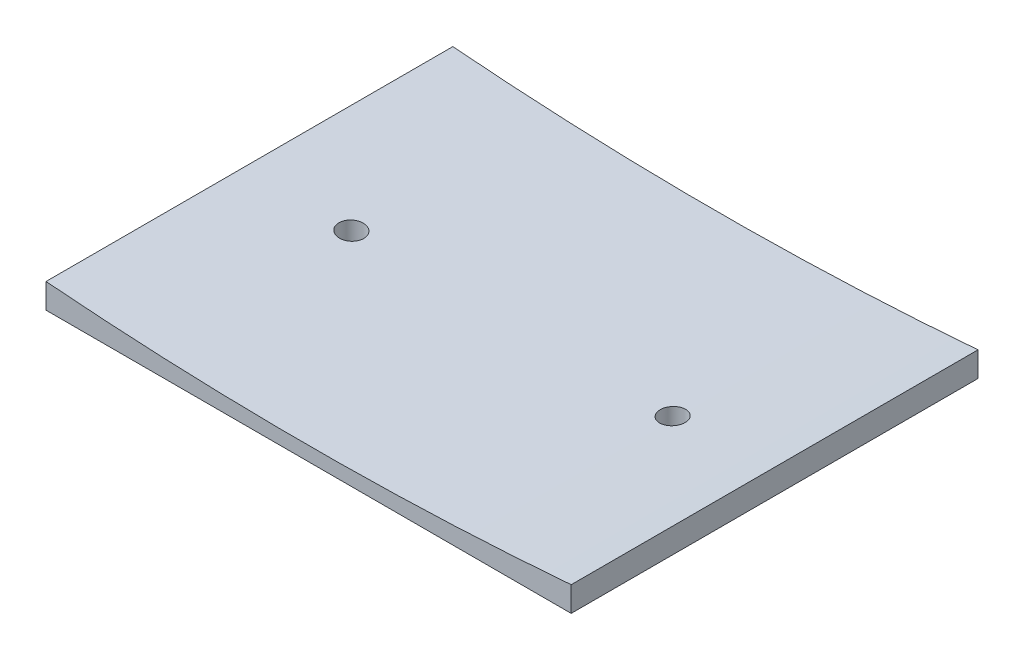
ISO-10303-21;
HEADER;
FILE_DESCRIPTION(('STEP AP214'),'2;1');
FILE_NAME('part.step','',(''),(''),'','','');
FILE_SCHEMA(('AUTOMOTIVE_DESIGN { 1 0 10303 214 1 1 1 1 }'));
ENDSEC;
DATA;
#1=APPLICATION_CONTEXT('core data for automotive mechanical design processes');
#2=APPLICATION_PROTOCOL_DEFINITION('international standard','automotive_design',2000,#1);
#3=PRODUCT_CONTEXT('',#1,'mechanical');
#4=PRODUCT('Part','Part','',(#3));
#5=PRODUCT_RELATED_PRODUCT_CATEGORY('part','',(#4));
#6=PRODUCT_DEFINITION_FORMATION('','',#4);
#7=PRODUCT_DEFINITION_CONTEXT('part definition',#1,'design');
#8=PRODUCT_DEFINITION('design','',#6,#7);
#9=PRODUCT_DEFINITION_SHAPE('','',#8);
#10=(LENGTH_UNIT() NAMED_UNIT(*) SI_UNIT(.MILLI.,.METRE.));
#11=(NAMED_UNIT(*) PLANE_ANGLE_UNIT() SI_UNIT($,.RADIAN.));
#12=(NAMED_UNIT(*) SI_UNIT($,.STERADIAN.) SOLID_ANGLE_UNIT());
#13=UNCERTAINTY_MEASURE_WITH_UNIT(LENGTH_MEASURE(1.E-05),#10,'distance_accuracy_value','');
#14=(GEOMETRIC_REPRESENTATION_CONTEXT(3) GLOBAL_UNCERTAINTY_ASSIGNED_CONTEXT((#13)) GLOBAL_UNIT_ASSIGNED_CONTEXT((#10,
#11,#12)) REPRESENTATION_CONTEXT('',''));
#15=CARTESIAN_POINT('',(0.,0.,0.));
#16=DIRECTION('',(0.,0.,1.));
#17=DIRECTION('',(1.,0.,0.));
#18=AXIS2_PLACEMENT_3D('',#15,#16,#17);
#19=CARTESIAN_POINT('',(-18.6005226480836,2.5,-9.07029616724739));
#20=DIRECTION('',(1.,0.,0.));
#21=DIRECTION('',(0.,0.,-1.));
#22=AXIS2_PLACEMENT_3D('',#19,#20,#21);
#23=PLANE('',#22);
#24=DIRECTION('',(0.,0.,1.));
#25=VECTOR('',#24,1.);
#26=CARTESIAN_POINT('',(-18.6005226480836,0.,-9.07029616724739));
#27=LINE('',#26,#25);
#28=CARTESIAN_POINT('',(-18.6005226480836,0.,-9.07029616724739));
#29=VERTEX_POINT('',#28);
#30=CARTESIAN_POINT('',(-18.6005226480836,0.,31.8297038327526));
#31=VERTEX_POINT('',#30);
#32=EDGE_CURVE('E105',#29,#31,#27,.T.);
#33=ORIENTED_EDGE('',*,*,#32,.T.);
#34=DIRECTION('',(0.,-1.,0.));
#35=VECTOR('',#34,1.);
#36=CARTESIAN_POINT('',(-18.6005226480836,2.5,31.8297038327526));
#37=LINE('',#36,#35);
#38=CARTESIAN_POINT('',(-18.6005226480836,2.5,31.8297038327526));
#39=VERTEX_POINT('',#38);
#40=EDGE_CURVE('E11',#39,#31,#37,.T.);
#41=ORIENTED_EDGE('',*,*,#40,.F.);
#42=DIRECTION('',(0.,0.,1.));
#43=VECTOR('',#42,1.);
#44=CARTESIAN_POINT('',(-18.6005226480836,2.5,-9.07029616724739));
#45=LINE('',#44,#43);
#46=CARTESIAN_POINT('',(-18.6005226480836,2.5,-9.07029616724739));
#47=VERTEX_POINT('',#46);
#48=EDGE_CURVE('E107',#47,#39,#45,.T.);
#49=ORIENTED_EDGE('',*,*,#48,.F.);
#50=DIRECTION('',(0.,-1.,0.));
#51=VECTOR('',#50,1.);
#52=CARTESIAN_POINT('',(-18.6005226480836,2.5,-9.07029616724739));
#53=LINE('',#52,#51);
#54=EDGE_CURVE('E100',#47,#29,#53,.T.);
#55=ORIENTED_EDGE('',*,*,#54,.T.);
#56=EDGE_LOOP('',(#33,#41,#49,#55));
#57=FACE_BOUND('',#56,.T.);
#58=ADVANCED_FACE('F40',(#57),#23,.F.);
#59=CARTESIAN_POINT('',(-18.6005226480836,2.5,31.8297038327526));
#60=DIRECTION('',(0.,0.,-1.));
#61=DIRECTION('',(-1.,0.,0.));
#62=AXIS2_PLACEMENT_3D('',#59,#60,#61);
#63=PLANE('',#62);
#64=DIRECTION('',(0.,-1.,0.));
#65=VECTOR('',#64,1.);
#66=CARTESIAN_POINT('',(34.1994773519164,2.5,31.8297038327526));
#67=LINE('',#66,#65);
#68=CARTESIAN_POINT('',(34.1994773519164,2.5,31.8297038327526));
#69=VERTEX_POINT('',#68);
#70=CARTESIAN_POINT('',(34.1994773519164,0.,31.8297038327526));
#71=VERTEX_POINT('',#70);
#72=EDGE_CURVE('E55',#69,#71,#67,.T.);
#73=ORIENTED_EDGE('',*,*,#72,.F.);
#74=CARTESIAN_POINT('',(7.79947735191637,325.208465073981,31.8297038327526));
#75=DIRECTION('',(0.,0.,1.));
#76=DIRECTION('',(1.,0.,0.));
#77=AXIS2_PLACEMENT_3D('',#74,#75,#76);
#78=CIRCLE('',#77,323.786524473155);
#79=EDGE_CURVE('E63',#39,#69,#78,.T.);
#80=ORIENTED_EDGE('',*,*,#79,.F.);
#81=ORIENTED_EDGE('',*,*,#40,.T.);
#82=DIRECTION('',(1.,0.,0.));
#83=VECTOR('',#82,1.);
#84=CARTESIAN_POINT('',(-18.6005226480836,0.,31.8297038327526));
#85=LINE('',#84,#83);
#86=EDGE_CURVE('E90',#31,#71,#85,.T.);
#87=ORIENTED_EDGE('',*,*,#86,.T.);
#88=EDGE_LOOP('',(#73,#80,#81,#87));
#89=FACE_BOUND('',#88,.T.);
#90=ADVANCED_FACE('F142',(#89),#63,.F.);
#91=CARTESIAN_POINT('',(34.1994773519164,2.5,-9.07029616724739));
#92=DIRECTION('',(-1.,0.,0.));
#93=DIRECTION('',(0.,0.,1.));
#94=AXIS2_PLACEMENT_3D('',#91,#92,#93);
#95=PLANE('',#94);
#96=DIRECTION('',(0.,0.,-1.));
#97=VECTOR('',#96,1.);
#98=CARTESIAN_POINT('',(34.1994773519164,0.,-9.07029616724739));
#99=LINE('',#98,#97);
#100=CARTESIAN_POINT('',(34.1994773519164,0.,-9.07029616724739));
#101=VERTEX_POINT('',#100);
#102=EDGE_CURVE('E81',#71,#101,#99,.T.);
#103=ORIENTED_EDGE('',*,*,#102,.T.);
#104=DIRECTION('',(0.,-1.,0.));
#105=VECTOR('',#104,1.);
#106=CARTESIAN_POINT('',(34.1994773519164,2.5,-9.07029616724739));
#107=LINE('',#106,#105);
#108=CARTESIAN_POINT('',(34.1994773519164,2.5,-9.07029616724739));
#109=VERTEX_POINT('',#108);
#110=EDGE_CURVE('E85',#109,#101,#107,.T.);
#111=ORIENTED_EDGE('',*,*,#110,.F.);
#112=DIRECTION('',(0.,0.,-1.));
#113=VECTOR('',#112,1.);
#114=CARTESIAN_POINT('',(34.1994773519164,2.5,-9.07029616724739));
#115=LINE('',#114,#113);
#116=EDGE_CURVE('E111',#69,#109,#115,.T.);
#117=ORIENTED_EDGE('',*,*,#116,.F.);
#118=ORIENTED_EDGE('',*,*,#72,.T.);
#119=EDGE_LOOP('',(#103,#111,#117,#118));
#120=FACE_BOUND('',#119,.T.);
#121=ADVANCED_FACE('F83',(#120),#95,.F.);
#122=CARTESIAN_POINT('',(-18.6005226480836,2.5,-9.07029616724739));
#123=DIRECTION('',(0.,0.,1.));
#124=DIRECTION('',(1.,0.,0.));
#125=AXIS2_PLACEMENT_3D('',#122,#123,#124);
#126=PLANE('',#125);
#127=ORIENTED_EDGE('',*,*,#54,.F.);
#128=CARTESIAN_POINT('',(7.79947735191637,325.208465073981,-9.07029616724739));
#129=DIRECTION('',(0.,0.,1.));
#130=DIRECTION('',(1.,0.,0.));
#131=AXIS2_PLACEMENT_3D('',#128,#129,#130);
#132=CIRCLE('',#131,323.786524473155);
#133=EDGE_CURVE('E98',#47,#109,#132,.T.);
#134=ORIENTED_EDGE('',*,*,#133,.T.);
#135=ORIENTED_EDGE('',*,*,#110,.T.);
#136=DIRECTION('',(-1.,0.,0.));
#137=VECTOR('',#136,1.);
#138=CARTESIAN_POINT('',(-18.6005226480836,0.,-9.07029616724739));
#139=LINE('',#138,#137);
#140=EDGE_CURVE('E89',#101,#29,#139,.T.);
#141=ORIENTED_EDGE('',*,*,#140,.T.);
#142=EDGE_LOOP('',(#127,#134,#135,#141));
#143=FACE_BOUND('',#142,.T.);
#144=ADVANCED_FACE('F95',(#143),#126,.F.);
#145=CARTESIAN_POINT('',(0.,0.,0.));
#146=DIRECTION('',(0.,1.,0.));
#147=DIRECTION('',(0.,0.,1.));
#148=AXIS2_PLACEMENT_3D('',#145,#146,#147);
#149=PLANE('',#148);
#150=CARTESIAN_POINT('',(23.9494773519164,0.,11.3797038327526));
#151=DIRECTION('',(0.,-1.,0.));
#152=DIRECTION('',(0.,0.,-1.));
#153=AXIS2_PLACEMENT_3D('',#150,#151,#152);
#154=CIRCLE('',#153,1.25);
#155=CARTESIAN_POINT('',(23.9494773519164,0.,10.1297038327526));
#156=VERTEX_POINT('',#155);
#157=EDGE_CURVE('E125',#156,#156,#154,.T.);
#158=ORIENTED_EDGE('',*,*,#157,.F.);
#159=EDGE_LOOP('',(#158));
#160=FACE_BOUND('',#159,.T.);
#161=CARTESIAN_POINT('',(-8.35052264808363,0.,11.3797038327526));
#162=DIRECTION('',(0.,-1.,0.));
#163=DIRECTION('',(0.,0.,1.));
#164=AXIS2_PLACEMENT_3D('',#161,#162,#163);
#165=CIRCLE('',#164,1.24999999999999);
#166=CARTESIAN_POINT('',(-8.35052264808363,0.,12.6297038327526));
#167=VERTEX_POINT('',#166);
#168=EDGE_CURVE('E162',#167,#167,#165,.T.);
#169=ORIENTED_EDGE('',*,*,#168,.F.);
#170=EDGE_LOOP('',(#169));
#171=FACE_BOUND('',#170,.T.);
#172=ORIENTED_EDGE('',*,*,#32,.F.);
#173=ORIENTED_EDGE('',*,*,#140,.F.);
#174=ORIENTED_EDGE('',*,*,#102,.F.);
#175=ORIENTED_EDGE('',*,*,#86,.F.);
#176=EDGE_LOOP('',(#172,#173,#174,#175));
#177=FACE_BOUND('',#176,.T.);
#178=ADVANCED_FACE('F103',(#160,#171,#177),#149,.F.);
#179=CARTESIAN_POINT('',(7.79947735191637,325.208465073981,-12.1702961672474));
#180=DIRECTION('',(0.,0.,1.));
#181=DIRECTION('',(1.,0.,0.));
#182=AXIS2_PLACEMENT_3D('',#179,#180,#181);
#183=CYLINDRICAL_SURFACE('',#182,323.786524473155);
#184=CARTESIAN_POINT('',(23.9494773519164,1.82496065483967,10.1297038327526));
#185=CARTESIAN_POINT('',(24.0197636927124,1.82847083703618,10.1297069401704));
#186=CARTESIAN_POINT('',(24.090099856463,1.83200666023192,10.1356518100633));
#187=CARTESIAN_POINT('',(24.2288338842924,1.83902539986659,10.1592847907752));
#188=CARTESIAN_POINT('',(24.2972293076047,1.84250824733175,10.1769870601796));
#189=CARTESIAN_POINT('',(24.4300532026421,1.84931212185383,10.2236342546326));
#190=CARTESIAN_POINT('',(24.494483470964,1.85263322205337,10.2525740439031));
#191=CARTESIAN_POINT('',(24.6175544571581,1.85901089956226,10.320871798772));
#192=CARTESIAN_POINT('',(24.6761966240745,1.86206754305425,10.3602271477185));
#193=CARTESIAN_POINT('',(24.7860210524993,1.86781840002,10.4482297549607));
#194=CARTESIAN_POINT('',(24.8372061267597,1.87051275011805,10.4968734936738));
#195=CARTESIAN_POINT('',(24.9306829686503,1.87545187969879,10.6020871717782));
#196=CARTESIAN_POINT('',(24.9729744394138,1.87769664417428,10.6586573756483));
#197=CARTESIAN_POINT('',(25.047403903478,1.88165849498276,10.7780402870238));
#198=CARTESIAN_POINT('',(25.0795547076515,1.88337624702382,10.8408449853713));
#199=CARTESIAN_POINT('',(25.132854998672,1.88622926840286,10.970973132148));
#200=CARTESIAN_POINT('',(25.1540045933826,1.88736454345185,11.0382965362652));
#201=CARTESIAN_POINT('',(25.1846760611835,1.88901231197104,11.1754580403795));
#202=CARTESIAN_POINT('',(25.1942128626014,1.88952560499937,11.2452927928032));
#203=CARTESIAN_POINT('',(25.2014351005326,1.88991424422863,11.3855739494131));
#204=CARTESIAN_POINT('',(25.1991206170339,1.88978959473524,11.4560203494679));
#205=CARTESIAN_POINT('',(25.1827123254534,1.88890699209856,11.5954757515237));
#206=CARTESIAN_POINT('',(25.1686263635739,1.88814946079861,11.6644856796016));
#207=CARTESIAN_POINT('',(25.1290884951054,1.88602787434271,11.7991589627235));
#208=CARTESIAN_POINT('',(25.1036365723563,1.88466381832441,11.8648223130093));
#209=CARTESIAN_POINT('',(25.0420841964588,1.88137544950612,11.9909622264446));
#210=CARTESIAN_POINT('',(25.005980431636,1.87945096246965,12.051437168951));
#211=CARTESIAN_POINT('',(24.9241566693137,1.87510697195462,12.1654676902541));
#212=CARTESIAN_POINT('',(24.8784366239669,1.87268746601301,12.21902323462));
#213=CARTESIAN_POINT('',(24.7786238885172,1.86743070371227,12.3177600163255));
#214=CARTESIAN_POINT('',(24.7245218705321,1.86459298211525,12.3629317991764));
#215=CARTESIAN_POINT('',(24.6095193416885,1.8585938376055,12.4435534695097));
#216=CARTESIAN_POINT('',(24.5486187791321,1.85543241223127,12.4790032830567));
#217=CARTESIAN_POINT('',(24.4216592958226,1.84888111373083,12.539224039541));
#218=CARTESIAN_POINT('',(24.3555935498903,1.84549093917783,12.563980560967));
#219=CARTESIAN_POINT('',(24.2202488855139,1.83858972829037,12.6020477640625));
#220=CARTESIAN_POINT('',(24.1509699483873,1.8350786912532,12.6153583791728));
#221=CARTESIAN_POINT('',(24.011097317626,1.82803629835686,12.6301650888787));
#222=CARTESIAN_POINT('',(23.9405024789726,1.82450492684527,12.6316503618577));
#223=CARTESIAN_POINT('',(23.8000630453098,1.81752575802991,12.6227348321638));
#224=CARTESIAN_POINT('',(23.730218451653,1.81407796087677,12.6123340080676));
#225=CARTESIAN_POINT('',(23.5932551643084,1.80736007121259,12.579936480853));
#226=CARTESIAN_POINT('',(23.5261367725719,1.80408999837263,12.5579384969967));
#227=CARTESIAN_POINT('',(23.396543160149,1.79781407226831,12.5029659795623));
#228=CARTESIAN_POINT('',(23.3340679266869,1.79480821827695,12.4699914761872));
#229=CARTESIAN_POINT('',(23.2155796409165,1.78913859251309,12.3940231013656));
#230=CARTESIAN_POINT('',(23.159562382274,1.78647459794465,12.351035807397));
#231=CARTESIAN_POINT('',(23.0555403472984,1.78155108956403,12.2562469969583));
#232=CARTESIAN_POINT('',(23.0075355308741,1.779291573728,12.2044455245935));
#233=CARTESIAN_POINT('',(22.9209564883051,1.77523211684377,12.0935578688271));
#234=CARTESIAN_POINT('',(22.8823722531984,1.77343168794443,12.0344795181192));
#235=CARTESIAN_POINT('',(22.815670600584,1.77032803619595,11.9106713861647));
#236=CARTESIAN_POINT('',(22.7875531110448,1.7690248099251,11.8459416438145));
#237=CARTESIAN_POINT('',(22.7426125401691,1.7669453980834,11.7127397103122));
#238=CARTESIAN_POINT('',(22.7257778903254,1.76616867267201,11.6442714305158));
#239=CARTESIAN_POINT('',(22.7038379767266,1.76515692361025,11.5054767391227));
#240=CARTESIAN_POINT('',(22.6987326853171,1.7649218986827,11.4351503319075));
#241=CARTESIAN_POINT('',(22.7003969649203,1.76499856769418,11.2946819512316));
#242=CARTESIAN_POINT('',(22.7071592311731,1.76530992532194,11.2245398909133));
#243=CARTESIAN_POINT('',(22.7323512703214,1.7664720306968,11.0863878802989));
#244=CARTESIAN_POINT('',(22.7507810543498,1.76732277895859,11.0183779320373));
#245=CARTESIAN_POINT('',(22.7987822714772,1.76954525177355,10.8864186213499));
#246=CARTESIAN_POINT('',(22.8283538978636,1.77091698536472,10.8224693293904));
#247=CARTESIAN_POINT('',(22.8977941498268,1.77415108877822,10.7004468339061));
#248=CARTESIAN_POINT('',(22.9376623944256,1.77601344044758,10.6423734130828));
#249=CARTESIAN_POINT('',(23.0265832549812,1.78018762635834,10.5337146775265));
#250=CARTESIAN_POINT('',(23.0756405100915,1.78249968766239,10.483133168352));
#251=CARTESIAN_POINT('',(23.1815464340428,1.78751926916149,10.3909101760858));
#252=CARTESIAN_POINT('',(23.2383970733411,1.79022688937996,10.3492709607941));
#253=CARTESIAN_POINT('',(23.358347279694,1.79597520178645,10.2760682381427));
#254=CARTESIAN_POINT('',(23.4214561006938,1.79901638794296,10.2445199522433));
#255=CARTESIAN_POINT('',(23.5520129794338,1.80534927992667,10.1925017892884));
#256=CARTESIAN_POINT('',(23.619455765119,1.80864068223828,10.1720187270501));
#257=CARTESIAN_POINT('',(23.7310177369714,1.81412172459221,10.1481568899067));
#258=CARTESIAN_POINT('',(23.774415530683,1.81626249436661,10.1412454949097));
#259=CARTESIAN_POINT('',(23.8616948542848,1.82058572660683,10.132017994559));
#260=CARTESIAN_POINT('',(23.9055763844538,1.82276818909667,10.1297018918542));
#261=CARTESIAN_POINT('',(23.9494773519164,1.82496065483967,10.1297038327526));
#262=B_SPLINE_CURVE_WITH_KNOTS('',3,(#184,#185,#186,#187,#188,#189,#190,#191,#192,#193,#194,
#195,#196,#197,#198,#199,#200,#201,#202,#203,#204,#205,#206,#207,#208,#209,#210,#211,#212,#213,
#214,#215,#216,#217,#218,#219,#220,#221,#222,#223,#224,#225,#226,#227,#228,#229,#230,#231,#232,
#233,#234,#235,#236,#237,#238,#239,#240,#241,#242,#243,#244,#245,#246,#247,#248,#249,#250,#251,
#252,#253,#254,#255,#256,#257,#258,#259,#260,#261),.UNSPECIFIED.,.T.,.F.,(4,2,2,2,2,2,2,2,2,2,2,
2,2,2,2,2,2,2,2,2,2,2,2,2,2,2,2,2,2,2,2,2,2,2,2,2,2,2,4),(0.,0.210961445976418,0.42217739928785,
0.633296935953374,0.844363484320879,1.05535021290774,1.26634398307263,1.47707012365299,
1.68779419808504,1.89824709828353,2.1086985780724,2.319009894577,2.52932151010123,
2.73969858086564,2.95007669842284,3.16069063970702,3.37130618266403,3.58220489212001,
3.79310482796703,4.00419774057292,4.2152910336482,4.42640764379786,4.63752367304456,
4.84850140776331,5.05947808680206,5.27022962714929,5.48097971709127,5.691513389082,
5.90204656469492,6.11245019765207,6.32285403137602,6.53326151532965,6.7436612152565,
6.95416742504453,7.16472695713277,7.37560262184145,7.58622645234494,7.71799325272559,
7.84976012905982),.UNSPECIFIED.);
#263=CARTESIAN_POINT('',(23.9494773519164,1.82496065483967,10.1297038327526));
#264=VERTEX_POINT('',#263);
#265=EDGE_CURVE('E43',#264,#264,#262,.T.);
#266=ORIENTED_EDGE('',*,*,#265,.T.);
#267=EDGE_LOOP('',(#266));
#268=FACE_BOUND('',#267,.T.);
#269=CARTESIAN_POINT('',(-8.35052264808363,1.82496065483967,10.1297038327526));
#270=CARTESIAN_POINT('',(-8.2802533206346,1.8214513879029,10.1297069367828));
#271=CARTESIAN_POINT('',(-8.20993197537328,1.81796266469561,10.1356489169305));
#272=CARTESIAN_POINT('',(-8.07122246023051,1.81112563486615,10.1592726591297));
#273=CARTESIAN_POINT('',(-8.00283671533242,1.80777750204441,10.1769685221743));
#274=CARTESIAN_POINT('',(-7.8700269183432,1.80131536180547,10.2236014768287));
#275=CARTESIAN_POINT('',(-7.80560111404975,1.79820125070009,10.252533554533));
#276=CARTESIAN_POINT('',(-7.68253610371129,1.79228661349517,10.3208151014158));
#277=CARTESIAN_POINT('',(-7.62389545139207,1.78948600899602,10.360161957819));
#278=CARTESIAN_POINT('',(-7.51407999617912,1.78426774573684,10.4481402133582));
#279=CARTESIAN_POINT('',(-7.46290135965026,1.78184989028312,10.4967668151349));
#280=CARTESIAN_POINT('',(-7.36943339091161,1.77745268900832,10.6019419322186));
#281=CARTESIAN_POINT('',(-7.3271443598723,1.77547335804388,10.6584907158126));
#282=CARTESIAN_POINT('',(-7.25270900476656,1.772000666679,10.7778353967209));
#283=CARTESIAN_POINT('',(-7.22055136405538,1.77050676400187,10.8406242200783));
#284=CARTESIAN_POINT('',(-7.16723361329538,1.76803514941895,10.9707187338223));
#285=CARTESIAN_POINT('',(-7.14607341946946,1.76705743358092,11.0380243897957));
#286=CARTESIAN_POINT('',(-7.11537019080422,1.76564015484676,11.175174873746));
#287=CARTESIAN_POINT('',(-7.10581638631984,1.76520009305573,11.2450172857647));
#288=CARTESIAN_POINT('',(-7.09856317007587,1.76486592130824,11.3853160451449));
#289=CARTESIAN_POINT('',(-7.10086369821165,1.76497180858368,11.4557723893918));
#290=CARTESIAN_POINT('',(-7.11724965781034,1.76572709470683,11.5952668613584));
#291=CARTESIAN_POINT('',(-7.13132996993247,1.76637625745414,11.6643055918036));
#292=CARTESIAN_POINT('',(-7.17086666249221,1.76820379089938,11.7990375028856));
#293=CARTESIAN_POINT('',(-7.19632305445975,1.76938216213367,11.8647306801316));
#294=CARTESIAN_POINT('',(-7.25789177415404,1.77224259639593,11.9909218714601));
#295=CARTESIAN_POINT('',(-7.29400621766464,1.77392475943514,12.0514188509376));
#296=CARTESIAN_POINT('',(-7.37585990329804,1.77775496344754,12.1654904983455));
#297=CARTESIAN_POINT('',(-7.42159917331454,1.77990300577088,12.2190651462136));
#298=CARTESIAN_POINT('',(-7.52144000643909,1.78461713568395,12.3178167096951));
#299=CARTESIAN_POINT('',(-7.5755479820325,1.78718354392689,12.3629871266373));
#300=CARTESIAN_POINT('',(-7.69056238946837,1.79267169295906,12.4436044001694));
#301=CARTESIAN_POINT('',(-7.75146886067799,1.79559343580588,12.4790512004499));
#302=CARTESIAN_POINT('',(-7.87842139782798,1.8017227826371,12.5392559517564));
#303=CARTESIAN_POINT('',(-7.94447296475408,1.80493069313062,12.5640022717659));
#304=CARTESIAN_POINT('',(-8.07978372283993,1.81154628328876,12.6020539304613));
#305=CARTESIAN_POINT('',(-8.14904293312667,1.81495396414463,12.6153592009157));
#306=CARTESIAN_POINT('',(-8.28887606734532,1.82188028964417,12.6301628137842));
#307=CARTESIAN_POINT('',(-8.35945122433839,1.82539904074686,12.6316494605732));
#308=CARTESIAN_POINT('',(-8.49984783033226,1.83244498273868,12.6227443267211));
#309=CARTESIAN_POINT('',(-8.5696692764736,1.83597217365977,12.6123525010308));
#310=CARTESIAN_POINT('',(-8.70660914549656,1.84293313847526,12.5799766288776));
#311=CARTESIAN_POINT('',(-8.77372633738022,1.84636686960034,12.5579873659315));
#312=CARTESIAN_POINT('',(-8.90331746851905,1.85303479718574,12.5030342787198));
#313=CARTESIAN_POINT('',(-8.9657914114036,1.85626899380202,12.4700704630326));
#314=CARTESIAN_POINT('',(-9.08429627270092,1.86243503320447,12.3941138263045));
#315=CARTESIAN_POINT('',(-9.140329560475,1.8653669871372,12.3511247110705));
#316=CARTESIAN_POINT('',(-9.24438227739315,1.87083503449103,12.2563270492435));
#317=CARTESIAN_POINT('',(-9.29240174600359,1.87337112986164,12.2045185460865));
#318=CARTESIAN_POINT('',(-9.37900622996026,1.87796076549204,12.0936129140148));
#319=CARTESIAN_POINT('',(-9.41760160383548,1.88001483547422,12.0345238960145));
#320=CARTESIAN_POINT('',(-9.48432218821434,1.88357456132654,11.9106889163692));
#321=CARTESIAN_POINT('',(-9.51244749056398,1.88508022200747,11.8459430043539));
#322=CARTESIAN_POINT('',(-9.55739098194091,1.88748978561689,11.7127261306692));
#323=CARTESIAN_POINT('',(-9.57422440757811,1.8883944994124,11.6442603238951));
#324=CARTESIAN_POINT('',(-9.59616263720363,1.88957409736451,11.5054694247033));
#325=CARTESIAN_POINT('',(-9.6012674930858,1.88984898430781,11.4351443405134));
#326=CARTESIAN_POINT('',(-9.59960300463452,1.88975940781789,11.2947004126789));
#327=CARTESIAN_POINT('',(-9.59284460647591,1.88939553376674,11.2245814386464));
#328=CARTESIAN_POINT('',(-9.567668379919,1.88804221714263,11.086475158246));
#329=CARTESIAN_POINT('',(-9.54925054393566,1.88705277416272,11.0184878532647));
#330=CARTESIAN_POINT('',(-9.50128193869314,1.88448246300705,10.8865721308741));
#331=CARTESIAN_POINT('',(-9.47173097827536,1.88290158467619,10.8226437831801));
#332=CARTESIAN_POINT('',(-9.40234095475783,1.87920243413527,10.7006590180522));
#333=CARTESIAN_POINT('',(-9.36250225443913,1.87708418087493,10.6426023936616));
#334=CARTESIAN_POINT('',(-9.27363474404567,1.8723794761978,10.5339533813351));
#335=CARTESIAN_POINT('',(-9.22459849406716,1.86979264580713,10.4833670957877));
#336=CARTESIAN_POINT('',(-9.11873550163968,1.86423625962667,10.3911300075647));
#337=CARTESIAN_POINT('',(-9.06190677351359,1.86126660629764,10.3494814893693));
#338=CARTESIAN_POINT('',(-8.94197924871632,1.85503510779494,10.2762424913001));
#339=CARTESIAN_POINT('',(-8.87886918952423,1.85177273884794,10.2446705210858));
#340=CARTESIAN_POINT('',(-8.7483027840944,1.84506476649636,10.1926067870018));
#341=CARTESIAN_POINT('',(-8.68085171355495,1.84161938636579,10.1721018475292));
#342=CARTESIAN_POINT('',(-8.56923212071711,1.83595442436919,10.1481995037555));
#343=CARTESIAN_POINT('',(-8.52578658861298,1.83375811490209,10.1412722993302));
#344=CARTESIAN_POINT('',(-8.43840837114761,1.82935874271232,10.1320234912686));
#345=CARTESIAN_POINT('',(-8.39447568540894,1.82715567998443,10.1297018912006));
#346=CARTESIAN_POINT('',(-8.35052264808363,1.82496065483967,10.1297038327526));
#347=B_SPLINE_CURVE_WITH_KNOTS('',3,(#269,#270,#271,#272,#273,#274,#275,#276,#277,#278,#279,
#280,#281,#282,#283,#284,#285,#286,#287,#288,#289,#290,#291,#292,#293,#294,#295,#296,#297,#298,
#299,#300,#301,#302,#303,#304,#305,#306,#307,#308,#309,#310,#311,#312,#313,#314,#315,#316,#317,
#318,#319,#320,#321,#322,#323,#324,#325,#326,#327,#328,#329,#330,#331,#332,#333,#334,#335,#336,
#337,#338,#339,#340,#341,#342,#343,#344,#345,#346),.UNSPECIFIED.,.T.,.F.,(4,2,2,2,2,2,2,2,2,2,2,
2,2,2,2,2,2,2,2,2,2,2,2,2,2,2,2,2,2,2,2,2,2,2,2,2,2,2,4),(0.,0.210910204566099,
0.422073893700729,0.633143463900912,0.8441601327802,1.05506800624125,1.26598302388798,
1.47666160973855,1.68733859064408,1.89781993330925,2.10830020877866,2.31868905974757,
2.52907812395113,2.73950898168068,2.94994044926806,3.16053396528908,3.37112870082953,
3.58195177294074,3.79277610233962,4.00380903604134,4.2148427700882,4.42597150736096,
4.63710007960394,4.84815073247306,5.0592003459315,5.2700169285016,5.48083166169407,
5.6913613582937,5.90189012338869,6.11222473657004,6.32255948658441,6.53289784826494,
6.7432287937049,6.95373061550561,7.16428617735025,7.3752263129258,7.58591476143337,
7.71783771057343,7.84976076192618),.UNSPECIFIED.);
#348=CARTESIAN_POINT('',(-8.35052264808363,1.82496065483967,10.1297038327526));
#349=VERTEX_POINT('',#348);
#350=EDGE_CURVE('E118',#349,#349,#347,.T.);
#351=ORIENTED_EDGE('',*,*,#350,.T.);
#352=EDGE_LOOP('',(#351));
#353=FACE_BOUND('',#352,.T.);
#354=ORIENTED_EDGE('',*,*,#48,.T.);
#355=ORIENTED_EDGE('',*,*,#79,.T.);
#356=ORIENTED_EDGE('',*,*,#116,.T.);
#357=ORIENTED_EDGE('',*,*,#133,.F.);
#358=EDGE_LOOP('',(#354,#355,#356,#357));
#359=FACE_BOUND('',#358,.T.);
#360=ADVANCED_FACE('F126',(#268,#353,#359),#183,.F.);
#361=CARTESIAN_POINT('',(-8.35052264808363,44.,11.3797038327526));
#362=DIRECTION('',(0.,-1.,0.));
#363=DIRECTION('',(0.,0.,-1.));
#364=AXIS2_PLACEMENT_3D('',#361,#362,#363);
#365=CYLINDRICAL_SURFACE('',#364,1.24999999999999);
#366=ORIENTED_EDGE('',*,*,#168,.T.);
#367=EDGE_LOOP('',(#366));
#368=FACE_BOUND('',#367,.T.);
#369=ORIENTED_EDGE('',*,*,#350,.F.);
#370=EDGE_LOOP('',(#369));
#371=FACE_BOUND('',#370,.T.);
#372=ADVANCED_FACE('F129',(#368,#371),#365,.F.);
#373=CARTESIAN_POINT('',(23.9494773519164,44.,11.3797038327526));
#374=DIRECTION('',(0.,-1.,0.));
#375=DIRECTION('',(0.,0.,-1.));
#376=AXIS2_PLACEMENT_3D('',#373,#374,#375);
#377=CYLINDRICAL_SURFACE('',#376,1.25);
#378=ORIENTED_EDGE('',*,*,#157,.T.);
#379=EDGE_LOOP('',(#378));
#380=FACE_BOUND('',#379,.T.);
#381=ORIENTED_EDGE('',*,*,#265,.F.);
#382=EDGE_LOOP('',(#381));
#383=FACE_BOUND('',#382,.T.);
#384=ADVANCED_FACE('F132',(#380,#383),#377,.F.);
#385=CLOSED_SHELL('',(#58,#90,#121,#144,#178,#360,#372,#384));
#386=MANIFOLD_SOLID_BREP('B2',#385);
#387=ADVANCED_BREP_SHAPE_REPRESENTATION('',(#18,#386),#14);
#388=SHAPE_DEFINITION_REPRESENTATION(#9,#387);
ENDSEC;
END-ISO-10303-21;
